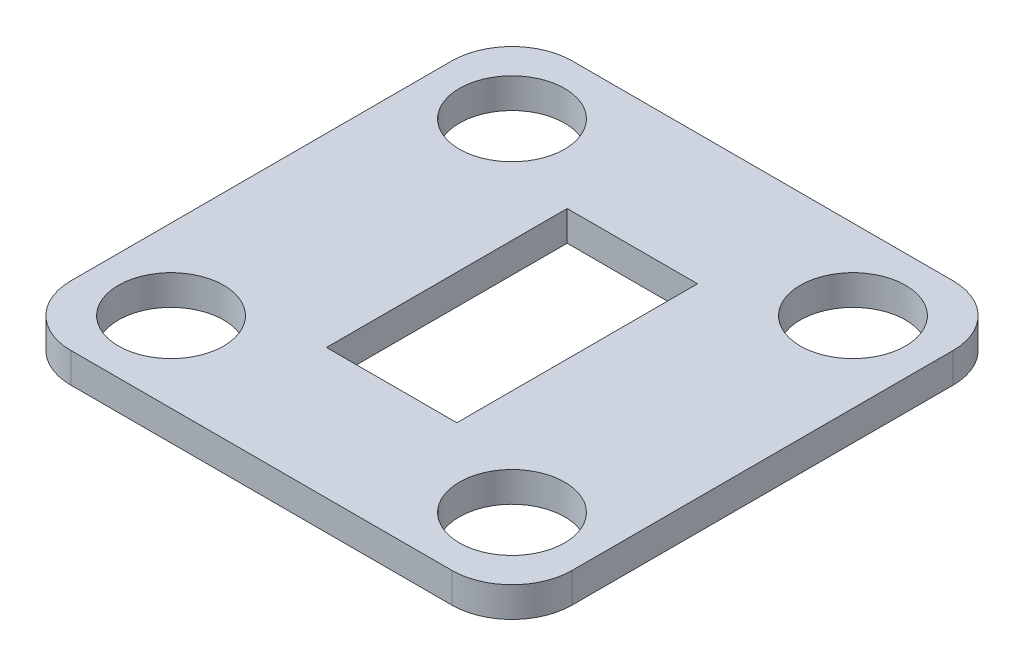
ISO-10303-21;
HEADER;
FILE_DESCRIPTION(('STEP AP214'),'2;1');
FILE_NAME('part.step','',(''),(''),'','','');
FILE_SCHEMA(('AUTOMOTIVE_DESIGN { 1 0 10303 214 1 1 1 1 }'));
ENDSEC;
DATA;
#1=APPLICATION_CONTEXT('core data for automotive mechanical design processes');
#2=APPLICATION_PROTOCOL_DEFINITION('international standard','automotive_design',2000,#1);
#3=PRODUCT_CONTEXT('',#1,'mechanical');
#4=PRODUCT('Part','Part','',(#3));
#5=PRODUCT_RELATED_PRODUCT_CATEGORY('part','',(#4));
#6=PRODUCT_DEFINITION_FORMATION('','',#4);
#7=PRODUCT_DEFINITION_CONTEXT('part definition',#1,'design');
#8=PRODUCT_DEFINITION('design','',#6,#7);
#9=PRODUCT_DEFINITION_SHAPE('','',#8);
#10=(LENGTH_UNIT() NAMED_UNIT(*) SI_UNIT(.MILLI.,.METRE.));
#11=(NAMED_UNIT(*) PLANE_ANGLE_UNIT() SI_UNIT($,.RADIAN.));
#12=(NAMED_UNIT(*) SI_UNIT($,.STERADIAN.) SOLID_ANGLE_UNIT());
#13=UNCERTAINTY_MEASURE_WITH_UNIT(LENGTH_MEASURE(1.E-05),#10,'distance_accuracy_value','');
#14=(GEOMETRIC_REPRESENTATION_CONTEXT(3) GLOBAL_UNCERTAINTY_ASSIGNED_CONTEXT((#13)) GLOBAL_UNIT_ASSIGNED_CONTEXT((#10,
#11,#12)) REPRESENTATION_CONTEXT('',''));
#15=CARTESIAN_POINT('',(0.,0.,0.));
#16=DIRECTION('',(0.,0.,1.));
#17=DIRECTION('',(1.,0.,0.));
#18=AXIS2_PLACEMENT_3D('',#15,#16,#17);
#19=CARTESIAN_POINT('',(25.,1.5,-25.));
#20=DIRECTION('',(-1.,0.,0.));
#21=DIRECTION('',(0.,0.,1.));
#22=AXIS2_PLACEMENT_3D('',#19,#20,#21);
#23=PLANE('',#22);
#24=DIRECTION('',(0.,0.,-1.));
#25=VECTOR('',#24,1.);
#26=CARTESIAN_POINT('',(25.,-1.5,-25.));
#27=LINE('',#26,#25);
#28=CARTESIAN_POINT('',(25.,-1.5,19.));
#29=VERTEX_POINT('',#28);
#30=CARTESIAN_POINT('',(25.,-1.5,-19.));
#31=VERTEX_POINT('',#30);
#32=EDGE_CURVE('E207',#29,#31,#27,.T.);
#33=ORIENTED_EDGE('',*,*,#32,.T.);
#34=DIRECTION('',(0.,-1.,0.));
#35=VECTOR('',#34,1.);
#36=CARTESIAN_POINT('',(25.,1.5,-19.));
#37=LINE('',#36,#35);
#38=CARTESIAN_POINT('',(25.,1.5,-19.));
#39=VERTEX_POINT('',#38);
#40=EDGE_CURVE('E262',#31,#39,#37,.F.);
#41=ORIENTED_EDGE('',*,*,#40,.T.);
#42=DIRECTION('',(0.,0.,-1.));
#43=VECTOR('',#42,1.);
#44=CARTESIAN_POINT('',(25.,1.5,-25.));
#45=LINE('',#44,#43);
#46=CARTESIAN_POINT('',(25.,1.5,19.));
#47=VERTEX_POINT('',#46);
#48=EDGE_CURVE('E208',#47,#39,#45,.T.);
#49=ORIENTED_EDGE('',*,*,#48,.F.);
#50=DIRECTION('',(0.,-1.,0.));
#51=VECTOR('',#50,1.);
#52=CARTESIAN_POINT('',(25.,1.5,19.));
#53=LINE('',#52,#51);
#54=EDGE_CURVE('E258',#47,#29,#53,.T.);
#55=ORIENTED_EDGE('',*,*,#54,.T.);
#56=EDGE_LOOP('',(#33,#41,#49,#55));
#57=FACE_BOUND('',#56,.T.);
#58=ADVANCED_FACE('F39',(#57),#23,.F.);
#59=CARTESIAN_POINT('',(-25.,1.5,-25.));
#60=DIRECTION('',(0.,0.,1.));
#61=DIRECTION('',(1.,0.,0.));
#62=AXIS2_PLACEMENT_3D('',#59,#60,#61);
#63=PLANE('',#62);
#64=DIRECTION('',(-1.,0.,0.));
#65=VECTOR('',#64,1.);
#66=CARTESIAN_POINT('',(-25.,1.5,-25.));
#67=LINE('',#66,#65);
#68=CARTESIAN_POINT('',(19.,1.5,-25.));
#69=VERTEX_POINT('',#68);
#70=CARTESIAN_POINT('',(-19.,1.5,-25.));
#71=VERTEX_POINT('',#70);
#72=EDGE_CURVE('E212',#69,#71,#67,.T.);
#73=ORIENTED_EDGE('',*,*,#72,.F.);
#74=DIRECTION('',(0.,-1.,0.));
#75=VECTOR('',#74,1.);
#76=CARTESIAN_POINT('',(19.,1.5,-25.));
#77=LINE('',#76,#75);
#78=CARTESIAN_POINT('',(19.,-1.5,-25.));
#79=VERTEX_POINT('',#78);
#80=EDGE_CURVE('E242',#69,#79,#77,.T.);
#81=ORIENTED_EDGE('',*,*,#80,.T.);
#82=DIRECTION('',(-1.,0.,0.));
#83=VECTOR('',#82,1.);
#84=CARTESIAN_POINT('',(-25.,-1.5,-25.));
#85=LINE('',#84,#83);
#86=CARTESIAN_POINT('',(-19.,-1.5,-25.));
#87=VERTEX_POINT('',#86);
#88=EDGE_CURVE('E229',#79,#87,#85,.T.);
#89=ORIENTED_EDGE('',*,*,#88,.T.);
#90=DIRECTION('',(0.,-1.,0.));
#91=VECTOR('',#90,1.);
#92=CARTESIAN_POINT('',(-19.,1.5,-25.));
#93=LINE('',#92,#91);
#94=EDGE_CURVE('E225',#87,#71,#93,.F.);
#95=ORIENTED_EDGE('',*,*,#94,.T.);
#96=EDGE_LOOP('',(#73,#81,#89,#95));
#97=FACE_BOUND('',#96,.T.);
#98=ADVANCED_FACE('F308',(#97),#63,.F.);
#99=CARTESIAN_POINT('',(-25.,1.5,-25.));
#100=DIRECTION('',(1.,0.,0.));
#101=DIRECTION('',(0.,0.,-1.));
#102=AXIS2_PLACEMENT_3D('',#99,#100,#101);
#103=PLANE('',#102);
#104=DIRECTION('',(0.,0.,1.));
#105=VECTOR('',#104,1.);
#106=CARTESIAN_POINT('',(-25.,1.5,-25.));
#107=LINE('',#106,#105);
#108=CARTESIAN_POINT('',(-25.,1.5,-19.));
#109=VERTEX_POINT('',#108);
#110=CARTESIAN_POINT('',(-25.,1.5,19.));
#111=VERTEX_POINT('',#110);
#112=EDGE_CURVE('E217',#109,#111,#107,.T.);
#113=ORIENTED_EDGE('',*,*,#112,.F.);
#114=DIRECTION('',(0.,-1.,0.));
#115=VECTOR('',#114,1.);
#116=CARTESIAN_POINT('',(-25.,1.5,-19.));
#117=LINE('',#116,#115);
#118=CARTESIAN_POINT('',(-25.,-1.5,-19.));
#119=VERTEX_POINT('',#118);
#120=EDGE_CURVE('E280',#109,#119,#117,.T.);
#121=ORIENTED_EDGE('',*,*,#120,.T.);
#122=DIRECTION('',(0.,0.,1.));
#123=VECTOR('',#122,1.);
#124=CARTESIAN_POINT('',(-25.,-1.5,-25.));
#125=LINE('',#124,#123);
#126=CARTESIAN_POINT('',(-25.,-1.5,19.));
#127=VERTEX_POINT('',#126);
#128=EDGE_CURVE('E233',#119,#127,#125,.T.);
#129=ORIENTED_EDGE('',*,*,#128,.T.);
#130=DIRECTION('',(0.,-1.,0.));
#131=VECTOR('',#130,1.);
#132=CARTESIAN_POINT('',(-25.,1.5,19.));
#133=LINE('',#132,#131);
#134=EDGE_CURVE('E277',#127,#111,#133,.F.);
#135=ORIENTED_EDGE('',*,*,#134,.T.);
#136=EDGE_LOOP('',(#113,#121,#129,#135));
#137=FACE_BOUND('',#136,.T.);
#138=ADVANCED_FACE('F317',(#137),#103,.F.);
#139=CARTESIAN_POINT('',(-25.,1.5,25.));
#140=DIRECTION('',(0.,0.,-1.));
#141=DIRECTION('',(-1.,0.,0.));
#142=AXIS2_PLACEMENT_3D('',#139,#140,#141);
#143=PLANE('',#142);
#144=DIRECTION('',(1.,0.,0.));
#145=VECTOR('',#144,1.);
#146=CARTESIAN_POINT('',(-25.,1.5,25.));
#147=LINE('',#146,#145);
#148=CARTESIAN_POINT('',(-19.,1.5,25.));
#149=VERTEX_POINT('',#148);
#150=CARTESIAN_POINT('',(19.,1.5,25.));
#151=VERTEX_POINT('',#150);
#152=EDGE_CURVE('E221',#149,#151,#147,.T.);
#153=ORIENTED_EDGE('',*,*,#152,.F.);
#154=DIRECTION('',(0.,-1.,0.));
#155=VECTOR('',#154,1.);
#156=CARTESIAN_POINT('',(-19.,1.5,25.));
#157=LINE('',#156,#155);
#158=CARTESIAN_POINT('',(-19.,-1.5,25.));
#159=VERTEX_POINT('',#158);
#160=EDGE_CURVE('E11',#149,#159,#157,.T.);
#161=ORIENTED_EDGE('',*,*,#160,.T.);
#162=DIRECTION('',(1.,0.,0.));
#163=VECTOR('',#162,1.);
#164=CARTESIAN_POINT('',(-25.,-1.5,25.));
#165=LINE('',#164,#163);
#166=CARTESIAN_POINT('',(19.,-1.5,25.));
#167=VERTEX_POINT('',#166);
#168=EDGE_CURVE('E213',#159,#167,#165,.T.);
#169=ORIENTED_EDGE('',*,*,#168,.T.);
#170=DIRECTION('',(0.,-1.,0.));
#171=VECTOR('',#170,1.);
#172=CARTESIAN_POINT('',(19.,1.5,25.));
#173=LINE('',#172,#171);
#174=EDGE_CURVE('E48',#167,#151,#173,.F.);
#175=ORIENTED_EDGE('',*,*,#174,.T.);
#176=EDGE_LOOP('',(#153,#161,#169,#175));
#177=FACE_BOUND('',#176,.T.);
#178=ADVANCED_FACE('F287',(#177),#143,.F.);
#179=CARTESIAN_POINT('',(0.,1.5,0.));
#180=DIRECTION('',(0.,1.,0.));
#181=DIRECTION('',(0.,0.,1.));
#182=AXIS2_PLACEMENT_3D('',#179,#180,#181);
#183=PLANE('',#182);
#184=DIRECTION('',(-1.,0.,0.));
#185=VECTOR('',#184,1.);
#186=CARTESIAN_POINT('',(-6.5,1.5,12.));
#187=LINE('',#186,#185);
#188=CARTESIAN_POINT('',(6.5,1.5,12.));
#189=VERTEX_POINT('',#188);
#190=CARTESIAN_POINT('',(-6.5,1.50000000000001,12.));
#191=VERTEX_POINT('',#190);
#192=EDGE_CURVE('E144',#189,#191,#187,.T.);
#193=ORIENTED_EDGE('',*,*,#192,.T.);
#194=DIRECTION('',(0.,0.,-1.));
#195=VECTOR('',#194,1.);
#196=CARTESIAN_POINT('',(-6.5,1.5,-12.));
#197=LINE('',#196,#195);
#198=CARTESIAN_POINT('',(-6.5,1.5,-12.));
#199=VERTEX_POINT('',#198);
#200=EDGE_CURVE('E130',#191,#199,#197,.T.);
#201=ORIENTED_EDGE('',*,*,#200,.T.);
#202=DIRECTION('',(1.,0.,0.));
#203=VECTOR('',#202,1.);
#204=CARTESIAN_POINT('',(-6.5,1.5,-12.));
#205=LINE('',#204,#203);
#206=CARTESIAN_POINT('',(6.5,1.5,-12.));
#207=VERTEX_POINT('',#206);
#208=EDGE_CURVE('E166',#199,#207,#205,.T.);
#209=ORIENTED_EDGE('',*,*,#208,.T.);
#210=DIRECTION('',(0.,0.,1.));
#211=VECTOR('',#210,1.);
#212=CARTESIAN_POINT('',(6.5,1.5,-12.));
#213=LINE('',#212,#211);
#214=EDGE_CURVE('E153',#207,#189,#213,.T.);
#215=ORIENTED_EDGE('',*,*,#214,.T.);
#216=EDGE_LOOP('',(#193,#201,#209,#215));
#217=FACE_BOUND('',#216,.T.);
#218=CARTESIAN_POINT('',(17.,1.5,-17.));
#219=DIRECTION('',(0.,1.,0.));
#220=DIRECTION('',(0.,0.,-1.));
#221=AXIS2_PLACEMENT_3D('',#218,#219,#220);
#222=CIRCLE('',#221,5.25);
#223=CARTESIAN_POINT('',(17.,1.5,-22.25));
#224=VERTEX_POINT('',#223);
#225=EDGE_CURVE('E175',#224,#224,#222,.T.);
#226=ORIENTED_EDGE('',*,*,#225,.F.);
#227=EDGE_LOOP('',(#226));
#228=FACE_BOUND('',#227,.T.);
#229=CARTESIAN_POINT('',(-17.,1.5,-17.));
#230=DIRECTION('',(0.,1.,0.));
#231=DIRECTION('',(0.,0.,1.));
#232=AXIS2_PLACEMENT_3D('',#229,#230,#231);
#233=CIRCLE('',#232,5.25);
#234=CARTESIAN_POINT('',(-17.,1.5,-11.75));
#235=VERTEX_POINT('',#234);
#236=EDGE_CURVE('E186',#235,#235,#233,.T.);
#237=ORIENTED_EDGE('',*,*,#236,.F.);
#238=EDGE_LOOP('',(#237));
#239=FACE_BOUND('',#238,.T.);
#240=CARTESIAN_POINT('',(-17.,1.5,17.));
#241=DIRECTION('',(0.,1.,0.));
#242=DIRECTION('',(0.,0.,-1.));
#243=AXIS2_PLACEMENT_3D('',#240,#241,#242);
#244=CIRCLE('',#243,5.25);
#245=CARTESIAN_POINT('',(-17.,1.5,11.75));
#246=VERTEX_POINT('',#245);
#247=EDGE_CURVE('E176',#246,#246,#244,.T.);
#248=ORIENTED_EDGE('',*,*,#247,.F.);
#249=EDGE_LOOP('',(#248));
#250=FACE_BOUND('',#249,.T.);
#251=CARTESIAN_POINT('',(17.,1.5,17.));
#252=DIRECTION('',(0.,1.,0.));
#253=DIRECTION('',(0.,0.,1.));
#254=AXIS2_PLACEMENT_3D('',#251,#252,#253);
#255=CIRCLE('',#254,5.25);
#256=CARTESIAN_POINT('',(17.,1.5,22.25));
#257=VERTEX_POINT('',#256);
#258=EDGE_CURVE('E185',#257,#257,#255,.T.);
#259=ORIENTED_EDGE('',*,*,#258,.F.);
#260=EDGE_LOOP('',(#259));
#261=FACE_BOUND('',#260,.T.);
#262=ORIENTED_EDGE('',*,*,#48,.T.);
#263=CARTESIAN_POINT('',(19.,1.5,-19.));
#264=DIRECTION('',(0.,1.,0.));
#265=DIRECTION('',(0.,0.,1.));
#266=AXIS2_PLACEMENT_3D('',#263,#264,#265);
#267=CIRCLE('',#266,6.);
#268=EDGE_CURVE('E274',#39,#69,#267,.T.);
#269=ORIENTED_EDGE('',*,*,#268,.T.);
#270=ORIENTED_EDGE('',*,*,#72,.T.);
#271=CARTESIAN_POINT('',(-19.,1.5,-19.));
#272=DIRECTION('',(0.,1.,0.));
#273=DIRECTION('',(0.,0.,1.));
#274=AXIS2_PLACEMENT_3D('',#271,#272,#273);
#275=CIRCLE('',#274,6.);
#276=EDGE_CURVE('E271',#71,#109,#275,.T.);
#277=ORIENTED_EDGE('',*,*,#276,.T.);
#278=ORIENTED_EDGE('',*,*,#112,.T.);
#279=CARTESIAN_POINT('',(-19.,1.5,19.));
#280=DIRECTION('',(0.,1.,0.));
#281=DIRECTION('',(0.,0.,1.));
#282=AXIS2_PLACEMENT_3D('',#279,#280,#281);
#283=CIRCLE('',#282,6.);
#284=EDGE_CURVE('E268',#111,#149,#283,.T.);
#285=ORIENTED_EDGE('',*,*,#284,.T.);
#286=ORIENTED_EDGE('',*,*,#152,.T.);
#287=CARTESIAN_POINT('',(19.,1.5,19.));
#288=DIRECTION('',(0.,1.,0.));
#289=DIRECTION('',(0.,0.,1.));
#290=AXIS2_PLACEMENT_3D('',#287,#288,#289);
#291=CIRCLE('',#290,6.);
#292=EDGE_CURVE('E265',#151,#47,#291,.T.);
#293=ORIENTED_EDGE('',*,*,#292,.T.);
#294=EDGE_LOOP('',(#262,#269,#270,#277,#278,#285,#286,#293));
#295=FACE_BOUND('',#294,.T.);
#296=ADVANCED_FACE('F151',(#217,#228,#239,#250,#261,#295),#183,.T.);
#297=CARTESIAN_POINT('',(0.,-1.5,0.));
#298=DIRECTION('',(0.,1.,0.));
#299=DIRECTION('',(0.,0.,1.));
#300=AXIS2_PLACEMENT_3D('',#297,#298,#299);
#301=PLANE('',#300);
#302=DIRECTION('',(0.,0.,-1.));
#303=VECTOR('',#302,1.);
#304=CARTESIAN_POINT('',(-6.5,-1.5,-12.));
#305=LINE('',#304,#303);
#306=CARTESIAN_POINT('',(-6.5,-1.5,12.));
#307=VERTEX_POINT('',#306);
#308=CARTESIAN_POINT('',(-6.5,-1.5,-12.));
#309=VERTEX_POINT('',#308);
#310=EDGE_CURVE('E157',#307,#309,#305,.T.);
#311=ORIENTED_EDGE('',*,*,#310,.F.);
#312=DIRECTION('',(-1.,0.,0.));
#313=VECTOR('',#312,1.);
#314=CARTESIAN_POINT('',(-6.5,-1.5,12.));
#315=LINE('',#314,#313);
#316=CARTESIAN_POINT('',(6.5,-1.5,12.));
#317=VERTEX_POINT('',#316);
#318=EDGE_CURVE('E147',#317,#307,#315,.T.);
#319=ORIENTED_EDGE('',*,*,#318,.F.);
#320=DIRECTION('',(0.,0.,1.));
#321=VECTOR('',#320,1.);
#322=CARTESIAN_POINT('',(6.5,-1.5,-12.));
#323=LINE('',#322,#321);
#324=CARTESIAN_POINT('',(6.5,-1.5,-12.));
#325=VERTEX_POINT('',#324);
#326=EDGE_CURVE('E161',#325,#317,#323,.T.);
#327=ORIENTED_EDGE('',*,*,#326,.F.);
#328=DIRECTION('',(1.,0.,0.));
#329=VECTOR('',#328,1.);
#330=CARTESIAN_POINT('',(-6.5,-1.5,-12.));
#331=LINE('',#330,#329);
#332=EDGE_CURVE('E63',#309,#325,#331,.T.);
#333=ORIENTED_EDGE('',*,*,#332,.F.);
#334=EDGE_LOOP('',(#311,#319,#327,#333));
#335=FACE_BOUND('',#334,.T.);
#336=CARTESIAN_POINT('',(17.,-1.5,-17.));
#337=DIRECTION('',(0.,1.,0.));
#338=DIRECTION('',(0.,0.,1.));
#339=AXIS2_PLACEMENT_3D('',#336,#337,#338);
#340=CIRCLE('',#339,5.25);
#341=CARTESIAN_POINT('',(17.,-1.5,-11.75));
#342=VERTEX_POINT('',#341);
#343=EDGE_CURVE('E190',#342,#342,#340,.F.);
#344=ORIENTED_EDGE('',*,*,#343,.F.);
#345=EDGE_LOOP('',(#344));
#346=FACE_BOUND('',#345,.T.);
#347=CARTESIAN_POINT('',(-17.,-1.5,-17.));
#348=DIRECTION('',(0.,1.,0.));
#349=DIRECTION('',(0.,0.,1.));
#350=AXIS2_PLACEMENT_3D('',#347,#348,#349);
#351=CIRCLE('',#350,5.25);
#352=CARTESIAN_POINT('',(-17.,-1.5,-11.75));
#353=VERTEX_POINT('',#352);
#354=EDGE_CURVE('E181',#353,#353,#351,.F.);
#355=ORIENTED_EDGE('',*,*,#354,.F.);
#356=EDGE_LOOP('',(#355));
#357=FACE_BOUND('',#356,.T.);
#358=CARTESIAN_POINT('',(-17.,-1.5,17.));
#359=DIRECTION('',(0.,1.,0.));
#360=DIRECTION('',(0.,0.,1.));
#361=AXIS2_PLACEMENT_3D('',#358,#359,#360);
#362=CIRCLE('',#361,5.25);
#363=CARTESIAN_POINT('',(-17.,-1.5,22.25));
#364=VERTEX_POINT('',#363);
#365=EDGE_CURVE('E180',#364,#364,#362,.F.);
#366=ORIENTED_EDGE('',*,*,#365,.F.);
#367=EDGE_LOOP('',(#366));
#368=FACE_BOUND('',#367,.T.);
#369=CARTESIAN_POINT('',(17.,-1.5,17.));
#370=DIRECTION('',(0.,1.,0.));
#371=DIRECTION('',(0.,0.,1.));
#372=AXIS2_PLACEMENT_3D('',#369,#370,#371);
#373=CIRCLE('',#372,5.25);
#374=CARTESIAN_POINT('',(17.,-1.5,22.25));
#375=VERTEX_POINT('',#374);
#376=EDGE_CURVE('E203',#375,#375,#373,.F.);
#377=ORIENTED_EDGE('',*,*,#376,.F.);
#378=EDGE_LOOP('',(#377));
#379=FACE_BOUND('',#378,.T.);
#380=ORIENTED_EDGE('',*,*,#88,.F.);
#381=CARTESIAN_POINT('',(19.,-1.5,-19.));
#382=DIRECTION('',(0.,1.,0.));
#383=DIRECTION('',(0.,0.,1.));
#384=AXIS2_PLACEMENT_3D('',#381,#382,#383);
#385=CIRCLE('',#384,6.);
#386=EDGE_CURVE('E255',#79,#31,#385,.F.);
#387=ORIENTED_EDGE('',*,*,#386,.T.);
#388=ORIENTED_EDGE('',*,*,#32,.F.);
#389=CARTESIAN_POINT('',(19.,-1.5,19.));
#390=DIRECTION('',(0.,1.,0.));
#391=DIRECTION('',(0.,0.,1.));
#392=AXIS2_PLACEMENT_3D('',#389,#390,#391);
#393=CIRCLE('',#392,6.);
#394=EDGE_CURVE('E246',#29,#167,#393,.F.);
#395=ORIENTED_EDGE('',*,*,#394,.T.);
#396=ORIENTED_EDGE('',*,*,#168,.F.);
#397=CARTESIAN_POINT('',(-19.,-1.5,19.));
#398=DIRECTION('',(0.,1.,0.));
#399=DIRECTION('',(0.,0.,1.));
#400=AXIS2_PLACEMENT_3D('',#397,#398,#399);
#401=CIRCLE('',#400,6.);
#402=EDGE_CURVE('E249',#159,#127,#401,.F.);
#403=ORIENTED_EDGE('',*,*,#402,.T.);
#404=ORIENTED_EDGE('',*,*,#128,.F.);
#405=CARTESIAN_POINT('',(-19.,-1.5,-19.));
#406=DIRECTION('',(0.,1.,0.));
#407=DIRECTION('',(0.,0.,1.));
#408=AXIS2_PLACEMENT_3D('',#405,#406,#407);
#409=CIRCLE('',#408,6.);
#410=EDGE_CURVE('E252',#119,#87,#409,.F.);
#411=ORIENTED_EDGE('',*,*,#410,.T.);
#412=EDGE_LOOP('',(#380,#387,#388,#395,#396,#403,#404,#411));
#413=FACE_BOUND('',#412,.T.);
#414=ADVANCED_FACE('F301',(#335,#346,#357,#368,#379,#413),#301,.F.);
#415=CARTESIAN_POINT('',(17.,-16.3492424049175,17.));
#416=DIRECTION('',(0.,1.,0.));
#417=DIRECTION('',(0.,0.,1.));
#418=AXIS2_PLACEMENT_3D('',#415,#416,#417);
#419=CYLINDRICAL_SURFACE('',#418,5.25);
#420=ORIENTED_EDGE('',*,*,#376,.T.);
#421=EDGE_LOOP('',(#420));
#422=FACE_BOUND('',#421,.T.);
#423=ORIENTED_EDGE('',*,*,#258,.T.);
#424=EDGE_LOOP('',(#423));
#425=FACE_BOUND('',#424,.T.);
#426=ADVANCED_FACE('F352',(#422,#425),#419,.F.);
#427=CARTESIAN_POINT('',(-17.,-16.3492424049175,17.));
#428=DIRECTION('',(0.,1.,0.));
#429=DIRECTION('',(0.,0.,1.));
#430=AXIS2_PLACEMENT_3D('',#427,#428,#429);
#431=CYLINDRICAL_SURFACE('',#430,5.25);
#432=ORIENTED_EDGE('',*,*,#365,.T.);
#433=EDGE_LOOP('',(#432));
#434=FACE_BOUND('',#433,.T.);
#435=ORIENTED_EDGE('',*,*,#247,.T.);
#436=EDGE_LOOP('',(#435));
#437=FACE_BOUND('',#436,.T.);
#438=ADVANCED_FACE('F346',(#434,#437),#431,.F.);
#439=CARTESIAN_POINT('',(-17.,-16.3492424049175,-17.));
#440=DIRECTION('',(0.,1.,0.));
#441=DIRECTION('',(0.,0.,1.));
#442=AXIS2_PLACEMENT_3D('',#439,#440,#441);
#443=CYLINDRICAL_SURFACE('',#442,5.25);
#444=ORIENTED_EDGE('',*,*,#354,.T.);
#445=EDGE_LOOP('',(#444));
#446=FACE_BOUND('',#445,.T.);
#447=ORIENTED_EDGE('',*,*,#236,.T.);
#448=EDGE_LOOP('',(#447));
#449=FACE_BOUND('',#448,.T.);
#450=ADVANCED_FACE('F340',(#446,#449),#443,.F.);
#451=CARTESIAN_POINT('',(17.,-16.3492424049175,-17.));
#452=DIRECTION('',(0.,1.,0.));
#453=DIRECTION('',(0.,0.,1.));
#454=AXIS2_PLACEMENT_3D('',#451,#452,#453);
#455=CYLINDRICAL_SURFACE('',#454,5.25);
#456=ORIENTED_EDGE('',*,*,#343,.T.);
#457=EDGE_LOOP('',(#456));
#458=FACE_BOUND('',#457,.T.);
#459=ORIENTED_EDGE('',*,*,#225,.T.);
#460=EDGE_LOOP('',(#459));
#461=FACE_BOUND('',#460,.T.);
#462=ADVANCED_FACE('F336',(#458,#461),#455,.F.);
#463=CARTESIAN_POINT('',(19.,1.5,-19.));
#464=DIRECTION('',(0.,-1.,0.));
#465=DIRECTION('',(0.,0.,-1.));
#466=AXIS2_PLACEMENT_3D('',#463,#464,#465);
#467=CYLINDRICAL_SURFACE('',#466,6.);
#468=ORIENTED_EDGE('',*,*,#268,.F.);
#469=ORIENTED_EDGE('',*,*,#40,.F.);
#470=ORIENTED_EDGE('',*,*,#386,.F.);
#471=ORIENTED_EDGE('',*,*,#80,.F.);
#472=EDGE_LOOP('',(#468,#469,#470,#471));
#473=FACE_BOUND('',#472,.T.);
#474=ADVANCED_FACE('F305',(#473),#467,.T.);
#475=CARTESIAN_POINT('',(-19.,1.5,-19.));
#476=DIRECTION('',(0.,-1.,0.));
#477=DIRECTION('',(0.,0.,-1.));
#478=AXIS2_PLACEMENT_3D('',#475,#476,#477);
#479=CYLINDRICAL_SURFACE('',#478,6.);
#480=ORIENTED_EDGE('',*,*,#276,.F.);
#481=ORIENTED_EDGE('',*,*,#94,.F.);
#482=ORIENTED_EDGE('',*,*,#410,.F.);
#483=ORIENTED_EDGE('',*,*,#120,.F.);
#484=EDGE_LOOP('',(#480,#481,#482,#483));
#485=FACE_BOUND('',#484,.T.);
#486=ADVANCED_FACE('F314',(#485),#479,.T.);
#487=CARTESIAN_POINT('',(-19.,1.5,19.));
#488=DIRECTION('',(0.,-1.,0.));
#489=DIRECTION('',(0.,0.,-1.));
#490=AXIS2_PLACEMENT_3D('',#487,#488,#489);
#491=CYLINDRICAL_SURFACE('',#490,6.);
#492=ORIENTED_EDGE('',*,*,#284,.F.);
#493=ORIENTED_EDGE('',*,*,#134,.F.);
#494=ORIENTED_EDGE('',*,*,#402,.F.);
#495=ORIENTED_EDGE('',*,*,#160,.F.);
#496=EDGE_LOOP('',(#492,#493,#494,#495));
#497=FACE_BOUND('',#496,.T.);
#498=ADVANCED_FACE('F320',(#497),#491,.T.);
#499=CARTESIAN_POINT('',(19.,1.5,19.));
#500=DIRECTION('',(0.,-1.,0.));
#501=DIRECTION('',(0.,0.,-1.));
#502=AXIS2_PLACEMENT_3D('',#499,#500,#501);
#503=CYLINDRICAL_SURFACE('',#502,6.);
#504=ORIENTED_EDGE('',*,*,#292,.F.);
#505=ORIENTED_EDGE('',*,*,#174,.F.);
#506=ORIENTED_EDGE('',*,*,#394,.F.);
#507=ORIENTED_EDGE('',*,*,#54,.F.);
#508=EDGE_LOOP('',(#504,#505,#506,#507));
#509=FACE_BOUND('',#508,.T.);
#510=ADVANCED_FACE('F41',(#509),#503,.T.);
#511=CARTESIAN_POINT('',(-6.5,28.7946881279124,12.));
#512=DIRECTION('',(0.,0.,1.));
#513=DIRECTION('',(1.,0.,0.));
#514=AXIS2_PLACEMENT_3D('',#511,#512,#513);
#515=PLANE('',#514);
#516=DIRECTION('',(0.,-1.,0.));
#517=VECTOR('',#516,1.);
#518=CARTESIAN_POINT('',(6.5,28.7946881279124,12.));
#519=LINE('',#518,#517);
#520=EDGE_CURVE('E55',#189,#317,#519,.T.);
#521=ORIENTED_EDGE('',*,*,#520,.T.);
#522=ORIENTED_EDGE('',*,*,#318,.T.);
#523=DIRECTION('',(0.,-1.,0.));
#524=VECTOR('',#523,1.);
#525=CARTESIAN_POINT('',(-6.5,28.7946881279124,12.));
#526=LINE('',#525,#524);
#527=EDGE_CURVE('E134',#191,#307,#526,.T.);
#528=ORIENTED_EDGE('',*,*,#527,.F.);
#529=ORIENTED_EDGE('',*,*,#192,.F.);
#530=EDGE_LOOP('',(#521,#522,#528,#529));
#531=FACE_BOUND('',#530,.T.);
#532=ADVANCED_FACE('F143',(#531),#515,.F.);
#533=CARTESIAN_POINT('',(-6.5,28.7946881279124,-12.));
#534=DIRECTION('',(-1.,0.,0.));
#535=DIRECTION('',(0.,0.,1.));
#536=AXIS2_PLACEMENT_3D('',#533,#534,#535);
#537=PLANE('',#536);
#538=ORIENTED_EDGE('',*,*,#527,.T.);
#539=ORIENTED_EDGE('',*,*,#310,.T.);
#540=DIRECTION('',(0.,-1.,0.));
#541=VECTOR('',#540,1.);
#542=CARTESIAN_POINT('',(-6.5,28.7946881279124,-12.));
#543=LINE('',#542,#541);
#544=EDGE_CURVE('E136',#199,#309,#543,.T.);
#545=ORIENTED_EDGE('',*,*,#544,.F.);
#546=ORIENTED_EDGE('',*,*,#200,.F.);
#547=EDGE_LOOP('',(#538,#539,#545,#546));
#548=FACE_BOUND('',#547,.T.);
#549=ADVANCED_FACE('F132',(#548),#537,.F.);
#550=CARTESIAN_POINT('',(-6.5,28.7946881279124,-12.));
#551=DIRECTION('',(0.,0.,-1.));
#552=DIRECTION('',(-1.,0.,0.));
#553=AXIS2_PLACEMENT_3D('',#550,#551,#552);
#554=PLANE('',#553);
#555=ORIENTED_EDGE('',*,*,#544,.T.);
#556=ORIENTED_EDGE('',*,*,#332,.T.);
#557=DIRECTION('',(0.,-1.,0.));
#558=VECTOR('',#557,1.);
#559=CARTESIAN_POINT('',(6.5,28.7946881279124,-12.));
#560=LINE('',#559,#558);
#561=EDGE_CURVE('E165',#207,#325,#560,.T.);
#562=ORIENTED_EDGE('',*,*,#561,.F.);
#563=ORIENTED_EDGE('',*,*,#208,.F.);
#564=EDGE_LOOP('',(#555,#556,#562,#563));
#565=FACE_BOUND('',#564,.T.);
#566=ADVANCED_FACE('F452',(#565),#554,.F.);
#567=CARTESIAN_POINT('',(6.5,28.7946881279124,-12.));
#568=DIRECTION('',(1.,0.,0.));
#569=DIRECTION('',(0.,0.,-1.));
#570=AXIS2_PLACEMENT_3D('',#567,#568,#569);
#571=PLANE('',#570);
#572=ORIENTED_EDGE('',*,*,#561,.T.);
#573=ORIENTED_EDGE('',*,*,#326,.T.);
#574=ORIENTED_EDGE('',*,*,#520,.F.);
#575=ORIENTED_EDGE('',*,*,#214,.F.);
#576=EDGE_LOOP('',(#572,#573,#574,#575));
#577=FACE_BOUND('',#576,.T.);
#578=ADVANCED_FACE('F460',(#577),#571,.F.);
#579=CLOSED_SHELL('',(#58,#98,#138,#178,#296,#414,#426,#438,#450,#462,#474,#486,#498,#510,#532,
#549,#566,#578));
#580=MANIFOLD_SOLID_BREP('B2',#579);
#581=ADVANCED_BREP_SHAPE_REPRESENTATION('',(#18,#580),#14);
#582=SHAPE_DEFINITION_REPRESENTATION(#9,#581);
ENDSEC;
END-ISO-10303-21;
